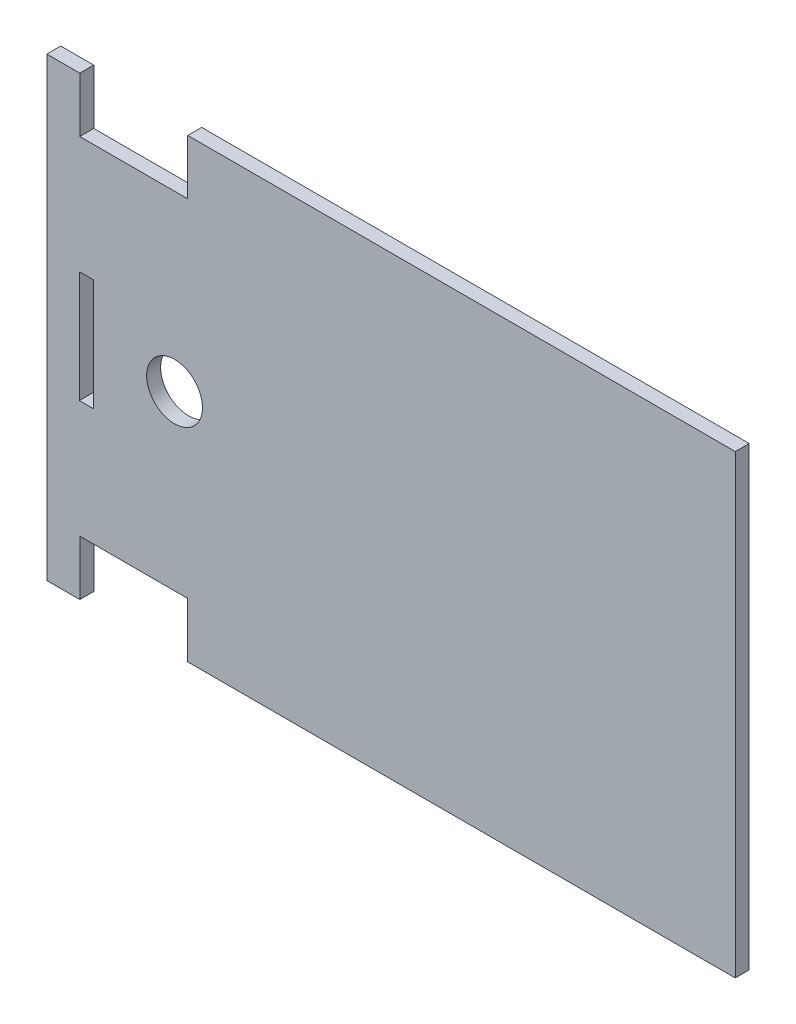
ISO-10303-21;
HEADER;
FILE_DESCRIPTION(('STEP AP214'),'2;1');
FILE_NAME('part.step','',(''),(''),'','','');
FILE_SCHEMA(('AUTOMOTIVE_DESIGN { 1 0 10303 214 1 1 1 1 }'));
ENDSEC;
DATA;
#1=APPLICATION_CONTEXT('core data for automotive mechanical design processes');
#2=APPLICATION_PROTOCOL_DEFINITION('international standard','automotive_design',2000,#1);
#3=PRODUCT_CONTEXT('',#1,'mechanical');
#4=PRODUCT('Part','Part','',(#3));
#5=PRODUCT_RELATED_PRODUCT_CATEGORY('part','',(#4));
#6=PRODUCT_DEFINITION_FORMATION('','',#4);
#7=PRODUCT_DEFINITION_CONTEXT('part definition',#1,'design');
#8=PRODUCT_DEFINITION('design','',#6,#7);
#9=PRODUCT_DEFINITION_SHAPE('','',#8);
#10=(LENGTH_UNIT() NAMED_UNIT(*) SI_UNIT(.MILLI.,.METRE.));
#11=(NAMED_UNIT(*) PLANE_ANGLE_UNIT() SI_UNIT($,.RADIAN.));
#12=(NAMED_UNIT(*) SI_UNIT($,.STERADIAN.) SOLID_ANGLE_UNIT());
#13=UNCERTAINTY_MEASURE_WITH_UNIT(LENGTH_MEASURE(1.E-05),#10,'distance_accuracy_value','');
#14=(GEOMETRIC_REPRESENTATION_CONTEXT(3) GLOBAL_UNCERTAINTY_ASSIGNED_CONTEXT((#13)) GLOBAL_UNIT_ASSIGNED_CONTEXT((#10,
#11,#12)) REPRESENTATION_CONTEXT('',''));
#15=CARTESIAN_POINT('',(0.,0.,0.));
#16=DIRECTION('',(0.,0.,1.));
#17=DIRECTION('',(1.,0.,0.));
#18=AXIS2_PLACEMENT_3D('',#15,#16,#17);
#19=CARTESIAN_POINT('',(0.,0.,3.));
#20=DIRECTION('',(0.,0.,-1.));
#21=DIRECTION('',(-1.,0.,0.));
#22=AXIS2_PLACEMENT_3D('',#19,#20,#21);
#23=PLANE('',#22);
#24=CARTESIAN_POINT('',(-12.0408449121838,39.7142447514254,3.));
#25=DIRECTION('',(0.,0.,1.));
#26=DIRECTION('',(1.,0.,0.));
#27=AXIS2_PLACEMENT_3D('',#24,#25,#26);
#28=CIRCLE('',#27,6.);
#29=CARTESIAN_POINT('',(-6.04084491218376,39.7142447514254,3.));
#30=VERTEX_POINT('',#29);
#31=EDGE_CURVE('E182',#30,#30,#28,.T.);
#32=ORIENTED_EDGE('',*,*,#31,.F.);
#33=EDGE_LOOP('',(#32));
#34=FACE_BOUND('',#33,.T.);
#35=DIRECTION('',(1.,0.,0.));
#36=VECTOR('',#35,1.);
#37=CARTESIAN_POINT('',(16.0020253318303,-9.1850594816002,3.));
#38=LINE('',#37,#36);
#39=CARTESIAN_POINT('',(-9.21128192000067,-9.18505948160021,3.));
#40=VERTEX_POINT('',#39);
#41=CARTESIAN_POINT('',(108.488718080001,-9.18505948160023,3.));
#42=VERTEX_POINT('',#41);
#43=EDGE_CURVE('E188',#40,#42,#38,.T.);
#44=ORIENTED_EDGE('',*,*,#43,.T.);
#45=DIRECTION('',(0.,1.,0.));
#46=VECTOR('',#45,1.);
#47=CARTESIAN_POINT('',(108.488718080001,88.8149405183998,3.));
#48=LINE('',#47,#46);
#49=CARTESIAN_POINT('',(108.488718080001,88.8149405183998,3.));
#50=VERTEX_POINT('',#49);
#51=EDGE_CURVE('E190',#42,#50,#48,.T.);
#52=ORIENTED_EDGE('',*,*,#51,.T.);
#53=DIRECTION('',(-1.,0.,0.));
#54=VECTOR('',#53,1.);
#55=CARTESIAN_POINT('',(24.4887180799989,88.8149405184002,3.));
#56=LINE('',#55,#54);
#57=CARTESIAN_POINT('',(-9.21128192000067,88.8149405183997,3.));
#58=VERTEX_POINT('',#57);
#59=EDGE_CURVE('E193',#50,#58,#56,.T.);
#60=ORIENTED_EDGE('',*,*,#59,.T.);
#61=DIRECTION('',(0.,-1.,0.));
#62=VECTOR('',#61,1.);
#63=CARTESIAN_POINT('',(-9.21128192000065,77.0149405183997,3.));
#64=LINE('',#63,#62);
#65=CARTESIAN_POINT('',(-9.21128192000065,77.0149405183997,3.));
#66=VERTEX_POINT('',#65);
#67=EDGE_CURVE('E195',#58,#66,#64,.T.);
#68=ORIENTED_EDGE('',*,*,#67,.T.);
#69=DIRECTION('',(-1.,0.,0.));
#70=VECTOR('',#69,1.);
#71=CARTESIAN_POINT('',(-32.4112819200007,77.0149405183997,3.));
#72=LINE('',#71,#70);
#73=CARTESIAN_POINT('',(-32.4112819200007,77.0149405183997,3.));
#74=VERTEX_POINT('',#73);
#75=EDGE_CURVE('E197',#66,#74,#72,.T.);
#76=ORIENTED_EDGE('',*,*,#75,.T.);
#77=DIRECTION('',(0.,1.,0.));
#78=VECTOR('',#77,1.);
#79=CARTESIAN_POINT('',(-32.4112819200005,88.8149405183998,3.));
#80=LINE('',#79,#78);
#81=CARTESIAN_POINT('',(-32.4112819200005,88.8149405183998,3.));
#82=VERTEX_POINT('',#81);
#83=EDGE_CURVE('E199',#74,#82,#80,.T.);
#84=ORIENTED_EDGE('',*,*,#83,.T.);
#85=DIRECTION('',(-1.,0.,0.));
#86=VECTOR('',#85,1.);
#87=CARTESIAN_POINT('',(-39.5112819200007,88.8149405183998,3.));
#88=LINE('',#87,#86);
#89=CARTESIAN_POINT('',(-39.5112819200007,88.8149405183998,3.));
#90=VERTEX_POINT('',#89);
#91=EDGE_CURVE('E201',#82,#90,#88,.T.);
#92=ORIENTED_EDGE('',*,*,#91,.T.);
#93=DIRECTION('',(0.,-1.,0.));
#94=VECTOR('',#93,1.);
#95=CARTESIAN_POINT('',(-39.5112819200007,-9.18505948160021,3.));
#96=LINE('',#95,#94);
#97=CARTESIAN_POINT('',(-39.5112819200007,-9.18505948160021,3.));
#98=VERTEX_POINT('',#97);
#99=EDGE_CURVE('E203',#90,#98,#96,.T.);
#100=ORIENTED_EDGE('',*,*,#99,.T.);
#101=DIRECTION('',(1.,0.,0.));
#102=VECTOR('',#101,1.);
#103=CARTESIAN_POINT('',(-39.5112819200007,-9.18505948160021,3.));
#104=LINE('',#103,#102);
#105=CARTESIAN_POINT('',(-32.4112819200007,-9.18505948160018,3.));
#106=VERTEX_POINT('',#105);
#107=EDGE_CURVE('E205',#98,#106,#104,.T.);
#108=ORIENTED_EDGE('',*,*,#107,.T.);
#109=DIRECTION('',(0.,1.,0.));
#110=VECTOR('',#109,1.);
#111=CARTESIAN_POINT('',(-32.4112819200007,2.61494051839978,3.));
#112=LINE('',#111,#110);
#113=CARTESIAN_POINT('',(-32.4112819200007,2.61494051839978,3.));
#114=VERTEX_POINT('',#113);
#115=EDGE_CURVE('E207',#106,#114,#112,.T.);
#116=ORIENTED_EDGE('',*,*,#115,.T.);
#117=DIRECTION('',(1.,0.,0.));
#118=VECTOR('',#117,1.);
#119=CARTESIAN_POINT('',(-9.2112819200007,2.61494051839975,3.));
#120=LINE('',#119,#118);
#121=CARTESIAN_POINT('',(-9.2112819200007,2.61494051839975,3.));
#122=VERTEX_POINT('',#121);
#123=EDGE_CURVE('E209',#114,#122,#120,.T.);
#124=ORIENTED_EDGE('',*,*,#123,.T.);
#125=DIRECTION('',(0.,-1.,0.));
#126=VECTOR('',#125,1.);
#127=CARTESIAN_POINT('',(-9.21128192000067,-9.18505948160021,3.));
#128=LINE('',#127,#126);
#129=EDGE_CURVE('E211',#122,#40,#128,.T.);
#130=ORIENTED_EDGE('',*,*,#129,.T.);
#131=EDGE_LOOP('',(#44,#52,#60,#68,#76,#84,#92,#100,#108,#116,#124,#130));
#132=FACE_BOUND('',#131,.T.);
#133=DIRECTION('',(0.,1.,0.));
#134=VECTOR('',#133,1.);
#135=CARTESIAN_POINT('',(-29.5112819200007,27.8149405183998,3.));
#136=LINE('',#135,#134);
#137=CARTESIAN_POINT('',(-29.5112819200007,27.8149405183998,3.));
#138=VERTEX_POINT('',#137);
#139=CARTESIAN_POINT('',(-29.5112819200007,51.8149405183998,3.));
#140=VERTEX_POINT('',#139);
#141=EDGE_CURVE('E146',#138,#140,#136,.T.);
#142=ORIENTED_EDGE('',*,*,#141,.F.);
#143=DIRECTION('',(1.,0.,0.));
#144=VECTOR('',#143,1.);
#145=CARTESIAN_POINT('',(-32.5112819200007,27.8149405183997,3.));
#146=LINE('',#145,#144);
#147=CARTESIAN_POINT('',(-32.5112819200007,27.8149405183997,3.));
#148=VERTEX_POINT('',#147);
#149=EDGE_CURVE('E168',#148,#138,#146,.T.);
#150=ORIENTED_EDGE('',*,*,#149,.F.);
#151=DIRECTION('',(0.,-1.,0.));
#152=VECTOR('',#151,1.);
#153=CARTESIAN_POINT('',(-32.5112819200007,51.8149405183998,3.));
#154=LINE('',#153,#152);
#155=CARTESIAN_POINT('',(-32.5112819200007,51.8149405183998,3.));
#156=VERTEX_POINT('',#155);
#157=EDGE_CURVE('E166',#156,#148,#154,.T.);
#158=ORIENTED_EDGE('',*,*,#157,.F.);
#159=DIRECTION('',(-1.,0.,0.));
#160=VECTOR('',#159,1.);
#161=CARTESIAN_POINT('',(-29.5112819200007,51.8149405183998,3.));
#162=LINE('',#161,#160);
#163=EDGE_CURVE('E154',#140,#156,#162,.T.);
#164=ORIENTED_EDGE('',*,*,#163,.F.);
#165=EDGE_LOOP('',(#142,#150,#158,#164));
#166=FACE_BOUND('',#165,.T.);
#167=ADVANCED_FACE('F33',(#34,#132,#166),#23,.F.);
#168=CARTESIAN_POINT('',(0.,0.,0.));
#169=DIRECTION('',(0.,0.,-1.));
#170=DIRECTION('',(-1.,0.,0.));
#171=AXIS2_PLACEMENT_3D('',#168,#169,#170);
#172=PLANE('',#171);
#173=DIRECTION('',(0.,1.,0.));
#174=VECTOR('',#173,1.);
#175=CARTESIAN_POINT('',(108.488718080001,88.8149405183998,0.));
#176=LINE('',#175,#174);
#177=CARTESIAN_POINT('',(108.488718080001,-9.18505948160023,0.));
#178=VERTEX_POINT('',#177);
#179=CARTESIAN_POINT('',(108.488718080001,88.8149405183998,0.));
#180=VERTEX_POINT('',#179);
#181=EDGE_CURVE('E185',#178,#180,#176,.T.);
#182=ORIENTED_EDGE('',*,*,#181,.F.);
#183=DIRECTION('',(1.,0.,0.));
#184=VECTOR('',#183,1.);
#185=CARTESIAN_POINT('',(-9.21128192000067,-9.18505948160021,0.));
#186=LINE('',#185,#184);
#187=CARTESIAN_POINT('',(-9.21128192000067,-9.18505948160021,0.));
#188=VERTEX_POINT('',#187);
#189=EDGE_CURVE('E191',#188,#178,#186,.T.);
#190=ORIENTED_EDGE('',*,*,#189,.F.);
#191=DIRECTION('',(0.,-1.,0.));
#192=VECTOR('',#191,1.);
#193=CARTESIAN_POINT('',(-9.21128192000067,-9.18505948160021,0.));
#194=LINE('',#193,#192);
#195=CARTESIAN_POINT('',(-9.2112819200007,2.61494051839975,0.));
#196=VERTEX_POINT('',#195);
#197=EDGE_CURVE('E235',#196,#188,#194,.T.);
#198=ORIENTED_EDGE('',*,*,#197,.F.);
#199=DIRECTION('',(1.,0.,0.));
#200=VECTOR('',#199,1.);
#201=CARTESIAN_POINT('',(-9.2112819200007,2.61494051839975,0.));
#202=LINE('',#201,#200);
#203=CARTESIAN_POINT('',(-32.4112819200007,2.61494051839978,0.));
#204=VERTEX_POINT('',#203);
#205=EDGE_CURVE('E233',#204,#196,#202,.T.);
#206=ORIENTED_EDGE('',*,*,#205,.F.);
#207=DIRECTION('',(0.,1.,0.));
#208=VECTOR('',#207,1.);
#209=CARTESIAN_POINT('',(-32.4112819200007,2.61494051839978,0.));
#210=LINE('',#209,#208);
#211=CARTESIAN_POINT('',(-32.4112819200007,-9.18505948160018,0.));
#212=VERTEX_POINT('',#211);
#213=EDGE_CURVE('E231',#212,#204,#210,.T.);
#214=ORIENTED_EDGE('',*,*,#213,.F.);
#215=DIRECTION('',(1.,0.,0.));
#216=VECTOR('',#215,1.);
#217=CARTESIAN_POINT('',(-39.5112819200007,-9.18505948160021,0.));
#218=LINE('',#217,#216);
#219=CARTESIAN_POINT('',(-39.5112819200007,-9.18505948160021,0.));
#220=VERTEX_POINT('',#219);
#221=EDGE_CURVE('E229',#220,#212,#218,.T.);
#222=ORIENTED_EDGE('',*,*,#221,.F.);
#223=DIRECTION('',(0.,-1.,0.));
#224=VECTOR('',#223,1.);
#225=CARTESIAN_POINT('',(-39.5112819200007,-9.18505948160021,0.));
#226=LINE('',#225,#224);
#227=CARTESIAN_POINT('',(-39.5112819200007,88.8149405183998,0.));
#228=VERTEX_POINT('',#227);
#229=EDGE_CURVE('E227',#228,#220,#226,.T.);
#230=ORIENTED_EDGE('',*,*,#229,.F.);
#231=DIRECTION('',(-1.,0.,0.));
#232=VECTOR('',#231,1.);
#233=CARTESIAN_POINT('',(-39.5112819200007,88.8149405183998,0.));
#234=LINE('',#233,#232);
#235=CARTESIAN_POINT('',(-32.4112819200005,88.8149405183998,0.));
#236=VERTEX_POINT('',#235);
#237=EDGE_CURVE('E225',#236,#228,#234,.T.);
#238=ORIENTED_EDGE('',*,*,#237,.F.);
#239=DIRECTION('',(0.,1.,0.));
#240=VECTOR('',#239,1.);
#241=CARTESIAN_POINT('',(-32.4112819200005,88.8149405183998,0.));
#242=LINE('',#241,#240);
#243=CARTESIAN_POINT('',(-32.4112819200007,77.0149405183997,0.));
#244=VERTEX_POINT('',#243);
#245=EDGE_CURVE('E223',#244,#236,#242,.T.);
#246=ORIENTED_EDGE('',*,*,#245,.F.);
#247=DIRECTION('',(-1.,0.,0.));
#248=VECTOR('',#247,1.);
#249=CARTESIAN_POINT('',(-32.4112819200007,77.0149405183997,0.));
#250=LINE('',#249,#248);
#251=CARTESIAN_POINT('',(-9.21128192000065,77.0149405183997,0.));
#252=VERTEX_POINT('',#251);
#253=EDGE_CURVE('E221',#252,#244,#250,.T.);
#254=ORIENTED_EDGE('',*,*,#253,.F.);
#255=DIRECTION('',(0.,-1.,0.));
#256=VECTOR('',#255,1.);
#257=CARTESIAN_POINT('',(-9.21128192000065,77.0149405183997,0.));
#258=LINE('',#257,#256);
#259=CARTESIAN_POINT('',(-9.21128192000067,88.8149405183997,0.));
#260=VERTEX_POINT('',#259);
#261=EDGE_CURVE('E219',#260,#252,#258,.T.);
#262=ORIENTED_EDGE('',*,*,#261,.F.);
#263=DIRECTION('',(-1.,0.,0.));
#264=VECTOR('',#263,1.);
#265=CARTESIAN_POINT('',(-9.21128192000067,88.8149405183997,0.));
#266=LINE('',#265,#264);
#267=EDGE_CURVE('E217',#180,#260,#266,.T.);
#268=ORIENTED_EDGE('',*,*,#267,.F.);
#269=EDGE_LOOP('',(#182,#190,#198,#206,#214,#222,#230,#238,#246,#254,#262,#268));
#270=FACE_BOUND('',#269,.T.);
#271=CARTESIAN_POINT('',(-12.0408449121838,39.7142447514254,0.));
#272=DIRECTION('',(0.,0.,1.));
#273=DIRECTION('',(1.,0.,0.));
#274=AXIS2_PLACEMENT_3D('',#271,#272,#273);
#275=CIRCLE('',#274,6.);
#276=CARTESIAN_POINT('',(-6.04084491218376,39.7142447514254,0.));
#277=VERTEX_POINT('',#276);
#278=EDGE_CURVE('E162',#277,#277,#275,.T.);
#279=ORIENTED_EDGE('',*,*,#278,.T.);
#280=EDGE_LOOP('',(#279));
#281=FACE_BOUND('',#280,.T.);
#282=DIRECTION('',(1.,0.,0.));
#283=VECTOR('',#282,1.);
#284=CARTESIAN_POINT('',(-32.5112819200007,27.8149405183997,0.));
#285=LINE('',#284,#283);
#286=CARTESIAN_POINT('',(-32.5112819200007,27.8149405183997,0.));
#287=VERTEX_POINT('',#286);
#288=CARTESIAN_POINT('',(-29.5112819200007,27.8149405183998,0.));
#289=VERTEX_POINT('',#288);
#290=EDGE_CURVE('E155',#287,#289,#285,.T.);
#291=ORIENTED_EDGE('',*,*,#290,.T.);
#292=DIRECTION('',(0.,1.,0.));
#293=VECTOR('',#292,1.);
#294=CARTESIAN_POINT('',(-29.5112819200007,27.8149405183998,0.));
#295=LINE('',#294,#293);
#296=CARTESIAN_POINT('',(-29.5112819200007,51.8149405183998,0.));
#297=VERTEX_POINT('',#296);
#298=EDGE_CURVE('E56',#289,#297,#295,.T.);
#299=ORIENTED_EDGE('',*,*,#298,.T.);
#300=DIRECTION('',(-1.,0.,0.));
#301=VECTOR('',#300,1.);
#302=CARTESIAN_POINT('',(-29.5112819200007,51.8149405183998,0.));
#303=LINE('',#302,#301);
#304=CARTESIAN_POINT('',(-32.5112819200007,51.8149405183998,0.));
#305=VERTEX_POINT('',#304);
#306=EDGE_CURVE('E161',#297,#305,#303,.T.);
#307=ORIENTED_EDGE('',*,*,#306,.T.);
#308=DIRECTION('',(0.,-1.,0.));
#309=VECTOR('',#308,1.);
#310=CARTESIAN_POINT('',(-32.5112819200007,51.8149405183998,0.));
#311=LINE('',#310,#309);
#312=EDGE_CURVE('E174',#305,#287,#311,.T.);
#313=ORIENTED_EDGE('',*,*,#312,.T.);
#314=EDGE_LOOP('',(#291,#299,#307,#313));
#315=FACE_BOUND('',#314,.T.);
#316=ADVANCED_FACE('F278',(#270,#281,#315),#172,.T.);
#317=CARTESIAN_POINT('',(108.488718080001,88.8149405183998,3.));
#318=DIRECTION('',(-1.,0.,0.));
#319=DIRECTION('',(0.,0.,1.));
#320=AXIS2_PLACEMENT_3D('',#317,#318,#319);
#321=PLANE('',#320);
#322=ORIENTED_EDGE('',*,*,#181,.T.);
#323=DIRECTION('',(0.,0.,-1.));
#324=VECTOR('',#323,1.);
#325=CARTESIAN_POINT('',(108.488718080001,88.8149405183998,3.));
#326=LINE('',#325,#324);
#327=EDGE_CURVE('E41',#50,#180,#326,.T.);
#328=ORIENTED_EDGE('',*,*,#327,.F.);
#329=ORIENTED_EDGE('',*,*,#51,.F.);
#330=DIRECTION('',(0.,0.,-1.));
#331=VECTOR('',#330,1.);
#332=CARTESIAN_POINT('',(108.488718080001,-9.18505948160023,3.));
#333=LINE('',#332,#331);
#334=EDGE_CURVE('E11',#42,#178,#333,.T.);
#335=ORIENTED_EDGE('',*,*,#334,.T.);
#336=EDGE_LOOP('',(#322,#328,#329,#335));
#337=FACE_BOUND('',#336,.T.);
#338=ADVANCED_FACE('F35',(#337),#321,.F.);
#339=CARTESIAN_POINT('',(-9.21128192000067,88.8149405183997,3.));
#340=DIRECTION('',(0.,-1.,0.));
#341=DIRECTION('',(1.,0.,0.));
#342=AXIS2_PLACEMENT_3D('',#339,#340,#341);
#343=PLANE('',#342);
#344=ORIENTED_EDGE('',*,*,#267,.T.);
#345=DIRECTION('',(0.,0.,-1.));
#346=VECTOR('',#345,1.);
#347=CARTESIAN_POINT('',(-9.21128192000067,88.8149405183997,3.));
#348=LINE('',#347,#346);
#349=EDGE_CURVE('E264',#58,#260,#348,.T.);
#350=ORIENTED_EDGE('',*,*,#349,.F.);
#351=ORIENTED_EDGE('',*,*,#59,.F.);
#352=ORIENTED_EDGE('',*,*,#327,.T.);
#353=EDGE_LOOP('',(#344,#350,#351,#352));
#354=FACE_BOUND('',#353,.T.);
#355=ADVANCED_FACE('F270',(#354),#343,.F.);
#356=CARTESIAN_POINT('',(-9.21128192000065,77.0149405183997,3.));
#357=DIRECTION('',(1.,0.,0.));
#358=DIRECTION('',(0.,1.,0.));
#359=AXIS2_PLACEMENT_3D('',#356,#357,#358);
#360=PLANE('',#359);
#361=ORIENTED_EDGE('',*,*,#261,.T.);
#362=DIRECTION('',(0.,0.,-1.));
#363=VECTOR('',#362,1.);
#364=CARTESIAN_POINT('',(-9.21128192000065,77.0149405183997,3.));
#365=LINE('',#364,#363);
#366=EDGE_CURVE('E261',#66,#252,#365,.T.);
#367=ORIENTED_EDGE('',*,*,#366,.F.);
#368=ORIENTED_EDGE('',*,*,#67,.F.);
#369=ORIENTED_EDGE('',*,*,#349,.T.);
#370=EDGE_LOOP('',(#361,#367,#368,#369));
#371=FACE_BOUND('',#370,.T.);
#372=ADVANCED_FACE('F286',(#371),#360,.F.);
#373=CARTESIAN_POINT('',(-32.4112819200007,77.0149405183997,3.));
#374=DIRECTION('',(0.,-1.,0.));
#375=DIRECTION('',(0.,0.,-1.));
#376=AXIS2_PLACEMENT_3D('',#373,#374,#375);
#377=PLANE('',#376);
#378=ORIENTED_EDGE('',*,*,#253,.T.);
#379=DIRECTION('',(0.,0.,-1.));
#380=VECTOR('',#379,1.);
#381=CARTESIAN_POINT('',(-32.4112819200007,77.0149405183997,3.));
#382=LINE('',#381,#380);
#383=EDGE_CURVE('E258',#74,#244,#382,.T.);
#384=ORIENTED_EDGE('',*,*,#383,.F.);
#385=ORIENTED_EDGE('',*,*,#75,.F.);
#386=ORIENTED_EDGE('',*,*,#366,.T.);
#387=EDGE_LOOP('',(#378,#384,#385,#386));
#388=FACE_BOUND('',#387,.T.);
#389=ADVANCED_FACE('F290',(#388),#377,.F.);
#390=CARTESIAN_POINT('',(-32.4112819200005,88.8149405183998,3.));
#391=DIRECTION('',(-1.,0.,0.));
#392=DIRECTION('',(0.,-1.,0.));
#393=AXIS2_PLACEMENT_3D('',#390,#391,#392);
#394=PLANE('',#393);
#395=ORIENTED_EDGE('',*,*,#245,.T.);
#396=DIRECTION('',(0.,0.,-1.));
#397=VECTOR('',#396,1.);
#398=CARTESIAN_POINT('',(-32.4112819200005,88.8149405183998,3.));
#399=LINE('',#398,#397);
#400=EDGE_CURVE('E255',#82,#236,#399,.T.);
#401=ORIENTED_EDGE('',*,*,#400,.F.);
#402=ORIENTED_EDGE('',*,*,#83,.F.);
#403=ORIENTED_EDGE('',*,*,#383,.T.);
#404=EDGE_LOOP('',(#395,#401,#402,#403));
#405=FACE_BOUND('',#404,.T.);
#406=ADVANCED_FACE('F327',(#405),#394,.F.);
#407=CARTESIAN_POINT('',(-39.5112819200007,88.8149405183998,3.));
#408=DIRECTION('',(0.,-1.,0.));
#409=DIRECTION('',(0.,0.,-1.));
#410=AXIS2_PLACEMENT_3D('',#407,#408,#409);
#411=PLANE('',#410);
#412=ORIENTED_EDGE('',*,*,#237,.T.);
#413=DIRECTION('',(0.,0.,-1.));
#414=VECTOR('',#413,1.);
#415=CARTESIAN_POINT('',(-39.5112819200007,88.8149405183998,3.));
#416=LINE('',#415,#414);
#417=EDGE_CURVE('E252',#90,#228,#416,.T.);
#418=ORIENTED_EDGE('',*,*,#417,.F.);
#419=ORIENTED_EDGE('',*,*,#91,.F.);
#420=ORIENTED_EDGE('',*,*,#400,.T.);
#421=EDGE_LOOP('',(#412,#418,#419,#420));
#422=FACE_BOUND('',#421,.T.);
#423=ADVANCED_FACE('F325',(#422),#411,.F.);
#424=CARTESIAN_POINT('',(-39.5112819200007,-9.18505948160021,3.));
#425=DIRECTION('',(1.,0.,0.));
#426=DIRECTION('',(0.,1.,0.));
#427=AXIS2_PLACEMENT_3D('',#424,#425,#426);
#428=PLANE('',#427);
#429=ORIENTED_EDGE('',*,*,#229,.T.);
#430=DIRECTION('',(0.,0.,-1.));
#431=VECTOR('',#430,1.);
#432=CARTESIAN_POINT('',(-39.5112819200007,-9.18505948160021,3.));
#433=LINE('',#432,#431);
#434=EDGE_CURVE('E249',#98,#220,#433,.T.);
#435=ORIENTED_EDGE('',*,*,#434,.F.);
#436=ORIENTED_EDGE('',*,*,#99,.F.);
#437=ORIENTED_EDGE('',*,*,#417,.T.);
#438=EDGE_LOOP('',(#429,#435,#436,#437));
#439=FACE_BOUND('',#438,.T.);
#440=ADVANCED_FACE('F320',(#439),#428,.F.);
#441=CARTESIAN_POINT('',(-39.5112819200007,-9.18505948160021,3.));
#442=DIRECTION('',(0.,1.,0.));
#443=DIRECTION('',(-1.,0.,0.));
#444=AXIS2_PLACEMENT_3D('',#441,#442,#443);
#445=PLANE('',#444);
#446=ORIENTED_EDGE('',*,*,#221,.T.);
#447=DIRECTION('',(0.,0.,-1.));
#448=VECTOR('',#447,1.);
#449=CARTESIAN_POINT('',(-32.4112819200007,-9.18505948160018,3.));
#450=LINE('',#449,#448);
#451=EDGE_CURVE('E246',#106,#212,#450,.T.);
#452=ORIENTED_EDGE('',*,*,#451,.F.);
#453=ORIENTED_EDGE('',*,*,#107,.F.);
#454=ORIENTED_EDGE('',*,*,#434,.T.);
#455=EDGE_LOOP('',(#446,#452,#453,#454));
#456=FACE_BOUND('',#455,.T.);
#457=ADVANCED_FACE('F315',(#456),#445,.F.);
#458=CARTESIAN_POINT('',(-32.4112819200007,2.61494051839978,3.));
#459=DIRECTION('',(-1.,0.,0.));
#460=DIRECTION('',(0.,0.,1.));
#461=AXIS2_PLACEMENT_3D('',#458,#459,#460);
#462=PLANE('',#461);
#463=ORIENTED_EDGE('',*,*,#213,.T.);
#464=DIRECTION('',(0.,0.,-1.));
#465=VECTOR('',#464,1.);
#466=CARTESIAN_POINT('',(-32.4112819200007,2.61494051839978,3.));
#467=LINE('',#466,#465);
#468=EDGE_CURVE('E243',#114,#204,#467,.T.);
#469=ORIENTED_EDGE('',*,*,#468,.F.);
#470=ORIENTED_EDGE('',*,*,#115,.F.);
#471=ORIENTED_EDGE('',*,*,#451,.T.);
#472=EDGE_LOOP('',(#463,#469,#470,#471));
#473=FACE_BOUND('',#472,.T.);
#474=ADVANCED_FACE('F311',(#473),#462,.F.);
#475=CARTESIAN_POINT('',(-9.2112819200007,2.61494051839975,3.));
#476=DIRECTION('',(0.,1.,0.));
#477=DIRECTION('',(-1.,0.,0.));
#478=AXIS2_PLACEMENT_3D('',#475,#476,#477);
#479=PLANE('',#478);
#480=ORIENTED_EDGE('',*,*,#205,.T.);
#481=DIRECTION('',(0.,0.,-1.));
#482=VECTOR('',#481,1.);
#483=CARTESIAN_POINT('',(-9.2112819200007,2.61494051839975,3.));
#484=LINE('',#483,#482);
#485=EDGE_CURVE('E240',#122,#196,#484,.T.);
#486=ORIENTED_EDGE('',*,*,#485,.F.);
#487=ORIENTED_EDGE('',*,*,#123,.F.);
#488=ORIENTED_EDGE('',*,*,#468,.T.);
#489=EDGE_LOOP('',(#480,#486,#487,#488));
#490=FACE_BOUND('',#489,.T.);
#491=ADVANCED_FACE('F306',(#490),#479,.F.);
#492=CARTESIAN_POINT('',(-9.21128192000067,-9.18505948160021,3.));
#493=DIRECTION('',(1.,0.,0.));
#494=DIRECTION('',(0.,1.,0.));
#495=AXIS2_PLACEMENT_3D('',#492,#493,#494);
#496=PLANE('',#495);
#497=ORIENTED_EDGE('',*,*,#197,.T.);
#498=DIRECTION('',(0.,0.,-1.));
#499=VECTOR('',#498,1.);
#500=CARTESIAN_POINT('',(-9.21128192000067,-9.18505948160021,3.));
#501=LINE('',#500,#499);
#502=EDGE_CURVE('E214',#40,#188,#501,.T.);
#503=ORIENTED_EDGE('',*,*,#502,.F.);
#504=ORIENTED_EDGE('',*,*,#129,.F.);
#505=ORIENTED_EDGE('',*,*,#485,.T.);
#506=EDGE_LOOP('',(#497,#503,#504,#505));
#507=FACE_BOUND('',#506,.T.);
#508=ADVANCED_FACE('F300',(#507),#496,.F.);
#509=CARTESIAN_POINT('',(-9.21128192000067,-9.18505948160021,3.));
#510=DIRECTION('',(0.,1.,0.));
#511=DIRECTION('',(-1.,0.,0.));
#512=AXIS2_PLACEMENT_3D('',#509,#510,#511);
#513=PLANE('',#512);
#514=ORIENTED_EDGE('',*,*,#189,.T.);
#515=ORIENTED_EDGE('',*,*,#334,.F.);
#516=ORIENTED_EDGE('',*,*,#43,.F.);
#517=ORIENTED_EDGE('',*,*,#502,.T.);
#518=EDGE_LOOP('',(#514,#515,#516,#517));
#519=FACE_BOUND('',#518,.T.);
#520=ADVANCED_FACE('F298',(#519),#513,.F.);
#521=CARTESIAN_POINT('',(-12.0408449121838,39.7142447514254,3.));
#522=DIRECTION('',(0.,0.,-1.));
#523=DIRECTION('',(-1.,0.,0.));
#524=AXIS2_PLACEMENT_3D('',#521,#522,#523);
#525=CYLINDRICAL_SURFACE('',#524,6.);
#526=ORIENTED_EDGE('',*,*,#31,.T.);
#527=EDGE_LOOP('',(#526));
#528=FACE_BOUND('',#527,.T.);
#529=ORIENTED_EDGE('',*,*,#278,.F.);
#530=EDGE_LOOP('',(#529));
#531=FACE_BOUND('',#530,.T.);
#532=ADVANCED_FACE('F345',(#528,#531),#525,.F.);
#533=CARTESIAN_POINT('',(-29.5112819200007,27.8149405183998,3.));
#534=DIRECTION('',(-1.,0.,0.));
#535=DIRECTION('',(0.,0.,1.));
#536=AXIS2_PLACEMENT_3D('',#533,#534,#535);
#537=PLANE('',#536);
#538=ORIENTED_EDGE('',*,*,#298,.F.);
#539=DIRECTION('',(0.,0.,-1.));
#540=VECTOR('',#539,1.);
#541=CARTESIAN_POINT('',(-29.5112819200007,27.8149405183998,3.));
#542=LINE('',#541,#540);
#543=EDGE_CURVE('E150',#138,#289,#542,.T.);
#544=ORIENTED_EDGE('',*,*,#543,.F.);
#545=ORIENTED_EDGE('',*,*,#141,.T.);
#546=DIRECTION('',(0.,0.,-1.));
#547=VECTOR('',#546,1.);
#548=CARTESIAN_POINT('',(-29.5112819200007,51.8149405183998,3.));
#549=LINE('',#548,#547);
#550=EDGE_CURVE('E149',#140,#297,#549,.T.);
#551=ORIENTED_EDGE('',*,*,#550,.T.);
#552=EDGE_LOOP('',(#538,#544,#545,#551));
#553=FACE_BOUND('',#552,.T.);
#554=ADVANCED_FACE('F148',(#553),#537,.T.);
#555=CARTESIAN_POINT('',(-29.5112819200007,51.8149405183998,3.));
#556=DIRECTION('',(0.,-1.,0.));
#557=DIRECTION('',(0.,0.,-1.));
#558=AXIS2_PLACEMENT_3D('',#555,#556,#557);
#559=PLANE('',#558);
#560=ORIENTED_EDGE('',*,*,#306,.F.);
#561=ORIENTED_EDGE('',*,*,#550,.F.);
#562=ORIENTED_EDGE('',*,*,#163,.T.);
#563=DIRECTION('',(0.,0.,-1.));
#564=VECTOR('',#563,1.);
#565=CARTESIAN_POINT('',(-32.5112819200007,51.8149405183998,3.));
#566=LINE('',#565,#564);
#567=EDGE_CURVE('E163',#156,#305,#566,.T.);
#568=ORIENTED_EDGE('',*,*,#567,.T.);
#569=EDGE_LOOP('',(#560,#561,#562,#568));
#570=FACE_BOUND('',#569,.T.);
#571=ADVANCED_FACE('F158',(#570),#559,.T.);
#572=CARTESIAN_POINT('',(-32.5112819200007,51.8149405183998,3.));
#573=DIRECTION('',(1.,0.,0.));
#574=DIRECTION('',(0.,1.,0.));
#575=AXIS2_PLACEMENT_3D('',#572,#573,#574);
#576=PLANE('',#575);
#577=ORIENTED_EDGE('',*,*,#312,.F.);
#578=ORIENTED_EDGE('',*,*,#567,.F.);
#579=ORIENTED_EDGE('',*,*,#157,.T.);
#580=DIRECTION('',(0.,0.,-1.));
#581=VECTOR('',#580,1.);
#582=CARTESIAN_POINT('',(-32.5112819200007,27.8149405183997,3.));
#583=LINE('',#582,#581);
#584=EDGE_CURVE('E48',#148,#287,#583,.T.);
#585=ORIENTED_EDGE('',*,*,#584,.T.);
#586=EDGE_LOOP('',(#577,#578,#579,#585));
#587=FACE_BOUND('',#586,.T.);
#588=ADVANCED_FACE('F400',(#587),#576,.T.);
#589=CARTESIAN_POINT('',(-32.5112819200007,27.8149405183997,3.));
#590=DIRECTION('',(0.,1.,0.));
#591=DIRECTION('',(-1.,0.,0.));
#592=AXIS2_PLACEMENT_3D('',#589,#590,#591);
#593=PLANE('',#592);
#594=ORIENTED_EDGE('',*,*,#290,.F.);
#595=ORIENTED_EDGE('',*,*,#584,.F.);
#596=ORIENTED_EDGE('',*,*,#149,.T.);
#597=ORIENTED_EDGE('',*,*,#543,.T.);
#598=EDGE_LOOP('',(#594,#595,#596,#597));
#599=FACE_BOUND('',#598,.T.);
#600=ADVANCED_FACE('F407',(#599),#593,.T.);
#601=CLOSED_SHELL('',(#167,#316,#338,#355,#372,#389,#406,#423,#440,#457,#474,#491,#508,#520,
#532,#554,#571,#588,#600));
#602=MANIFOLD_SOLID_BREP('B2',#601);
#603=ADVANCED_BREP_SHAPE_REPRESENTATION('',(#18,#602),#14);
#604=SHAPE_DEFINITION_REPRESENTATION(#9,#603);
ENDSEC;
END-ISO-10303-21;
